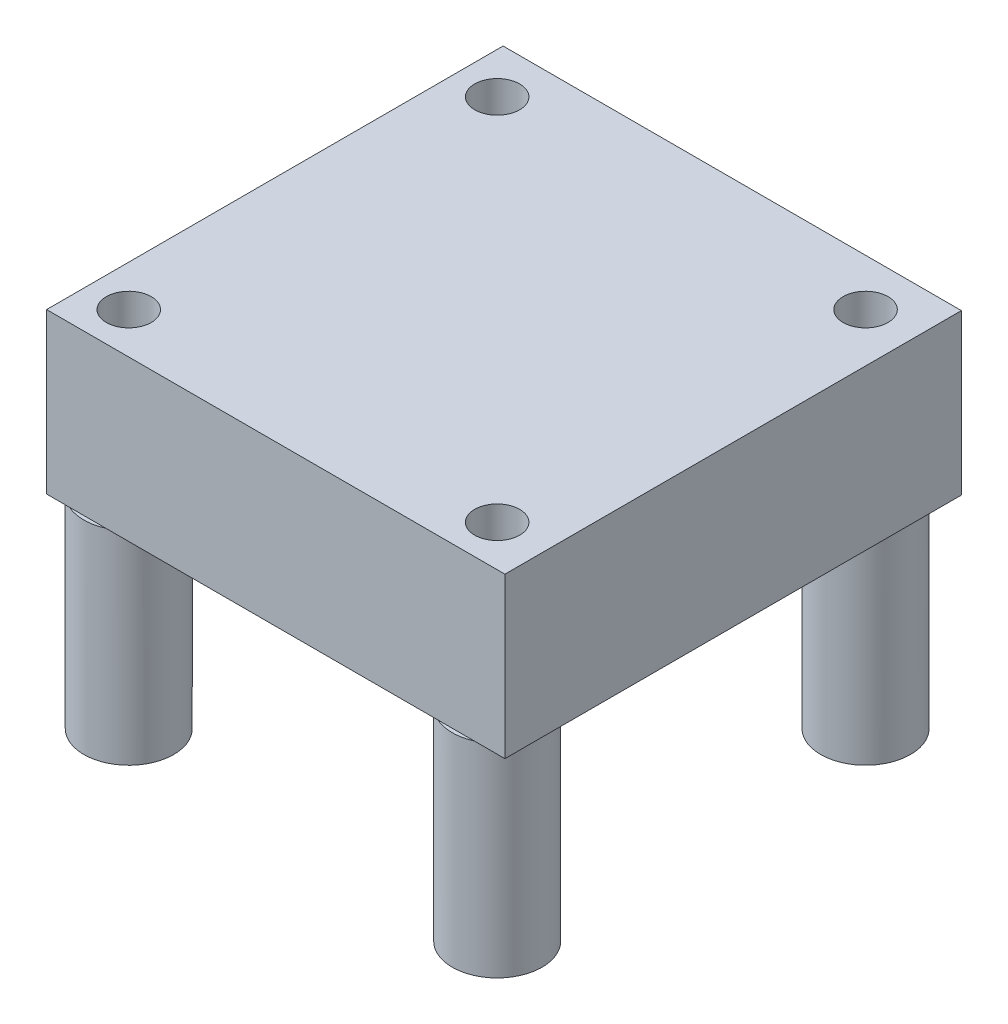
ISO-10303-21;
HEADER;
FILE_DESCRIPTION(('STEP AP214'),'2;1');
FILE_NAME('part.step','',(''),(''),'','','');
FILE_SCHEMA(('AUTOMOTIVE_DESIGN { 1 0 10303 214 1 1 1 1 }'));
ENDSEC;
DATA;
#1=APPLICATION_CONTEXT('core data for automotive mechanical design processes');
#2=APPLICATION_PROTOCOL_DEFINITION('international standard','automotive_design',2000,#1);
#3=PRODUCT_CONTEXT('',#1,'mechanical');
#4=PRODUCT('Part','Part','',(#3));
#5=PRODUCT_RELATED_PRODUCT_CATEGORY('part','',(#4));
#6=PRODUCT_DEFINITION_FORMATION('','',#4);
#7=PRODUCT_DEFINITION_CONTEXT('part definition',#1,'design');
#8=PRODUCT_DEFINITION('design','',#6,#7);
#9=PRODUCT_DEFINITION_SHAPE('','',#8);
#10=(LENGTH_UNIT() NAMED_UNIT(*) SI_UNIT(.MILLI.,.METRE.));
#11=(NAMED_UNIT(*) PLANE_ANGLE_UNIT() SI_UNIT($,.RADIAN.));
#12=(NAMED_UNIT(*) SI_UNIT($,.STERADIAN.) SOLID_ANGLE_UNIT());
#13=UNCERTAINTY_MEASURE_WITH_UNIT(LENGTH_MEASURE(1.E-05),#10,'distance_accuracy_value','');
#14=(GEOMETRIC_REPRESENTATION_CONTEXT(3) GLOBAL_UNCERTAINTY_ASSIGNED_CONTEXT((#13)) GLOBAL_UNIT_ASSIGNED_CONTEXT((#10,
#11,#12)) REPRESENTATION_CONTEXT('',''));
#15=CARTESIAN_POINT('',(0.,0.,0.));
#16=DIRECTION('',(0.,0.,1.));
#17=DIRECTION('',(1.,0.,0.));
#18=AXIS2_PLACEMENT_3D('',#15,#16,#17);
#19=CARTESIAN_POINT('',(0.,0.,0.));
#20=DIRECTION('',(0.,1.,0.));
#21=DIRECTION('',(0.,0.,1.));
#22=AXIS2_PLACEMENT_3D('',#19,#20,#21);
#23=PLANE('',#22);
#24=CARTESIAN_POINT('',(-14.5779448621554,0.,11.6379426065163));
#25=DIRECTION('',(0.,-1.,0.));
#26=DIRECTION('',(0.,0.,-1.));
#27=AXIS2_PLACEMENT_3D('',#24,#25,#26);
#28=CIRCLE('',#27,2.5);
#29=CARTESIAN_POINT('',(-15.58997450599,0.,13.9239426065163));
#30=VERTEX_POINT('',#29);
#31=CARTESIAN_POINT('',(-16.8639448621554,0.,12.6499722503509));
#32=VERTEX_POINT('',#31);
#33=EDGE_CURVE('E176',#30,#32,#28,.T.);
#34=ORIENTED_EDGE('',*,*,#33,.F.);
#35=DIRECTION('',(1.,0.,0.));
#36=VECTOR('',#35,1.);
#37=CARTESIAN_POINT('',(-16.8639448621554,0.,13.9239426065163));
#38=LINE('',#37,#36);
#39=CARTESIAN_POINT('',(-16.8639448621554,0.,13.9239426065163));
#40=VERTEX_POINT('',#39);
#41=EDGE_CURVE('E159',#40,#30,#38,.T.);
#42=ORIENTED_EDGE('',*,*,#41,.F.);
#43=DIRECTION('',(0.,0.,1.));
#44=VECTOR('',#43,1.);
#45=CARTESIAN_POINT('',(-16.8639448621554,0.,-11.4760573934837));
#46=LINE('',#45,#44);
#47=EDGE_CURVE('E111',#32,#40,#46,.T.);
#48=ORIENTED_EDGE('',*,*,#47,.F.);
#49=EDGE_LOOP('',(#34,#42,#48));
#50=FACE_BOUND('',#49,.T.);
#51=ADVANCED_FACE('F36',(#50),#23,.F.);
#52=CARTESIAN_POINT('',(-16.8639448621554,8.89,-11.4760573934837));
#53=DIRECTION('',(1.,0.,0.));
#54=DIRECTION('',(0.,0.,-1.));
#55=AXIS2_PLACEMENT_3D('',#52,#53,#54);
#56=PLANE('',#55);
#57=CARTESIAN_POINT('',(-16.8639448621554,0.,-11.4760573934837));
#58=VERTEX_POINT('',#57);
#59=CARTESIAN_POINT('',(-16.8639448621554,0.,-9.87188703731832));
#60=VERTEX_POINT('',#59);
#61=EDGE_CURVE('E106',#58,#60,#46,.T.);
#62=ORIENTED_EDGE('',*,*,#61,.T.);
#63=CARTESIAN_POINT('',(-16.8639448621554,0.,-7.8478277496491));
#64=VERTEX_POINT('',#63);
#65=EDGE_CURVE('E101',#60,#64,#46,.T.);
#66=ORIENTED_EDGE('',*,*,#65,.T.);
#67=CARTESIAN_POINT('',(-16.8639448621554,0.,10.6259129626817));
#68=VERTEX_POINT('',#67);
#69=EDGE_CURVE('E103',#64,#68,#46,.T.);
#70=ORIENTED_EDGE('',*,*,#69,.T.);
#71=EDGE_CURVE('E117',#68,#32,#46,.T.);
#72=ORIENTED_EDGE('',*,*,#71,.T.);
#73=ORIENTED_EDGE('',*,*,#47,.T.);
#74=DIRECTION('',(0.,-1.,0.));
#75=VECTOR('',#74,1.);
#76=CARTESIAN_POINT('',(-16.8639448621554,8.89,13.9239426065163));
#77=LINE('',#76,#75);
#78=CARTESIAN_POINT('',(-16.8639448621554,8.89,13.9239426065163));
#79=VERTEX_POINT('',#78);
#80=EDGE_CURVE('E173',#79,#40,#77,.T.);
#81=ORIENTED_EDGE('',*,*,#80,.F.);
#82=DIRECTION('',(0.,0.,1.));
#83=VECTOR('',#82,1.);
#84=CARTESIAN_POINT('',(-16.8639448621554,8.89,-11.4760573934837));
#85=LINE('',#84,#83);
#86=CARTESIAN_POINT('',(-16.8639448621554,8.89,-11.4760573934837));
#87=VERTEX_POINT('',#86);
#88=EDGE_CURVE('E147',#87,#79,#85,.T.);
#89=ORIENTED_EDGE('',*,*,#88,.F.);
#90=DIRECTION('',(0.,-1.,0.));
#91=VECTOR('',#90,1.);
#92=CARTESIAN_POINT('',(-16.8639448621554,8.89,-11.4760573934837));
#93=LINE('',#92,#91);
#94=EDGE_CURVE('E156',#87,#58,#93,.T.);
#95=ORIENTED_EDGE('',*,*,#94,.T.);
#96=EDGE_LOOP('',(#62,#66,#70,#72,#73,#81,#89,#95));
#97=FACE_BOUND('',#96,.T.);
#98=ADVANCED_FACE('F38',(#97),#56,.F.);
#99=CARTESIAN_POINT('',(-16.8639448621554,8.89,13.9239426065163));
#100=DIRECTION('',(0.,0.,-1.));
#101=DIRECTION('',(-1.,0.,0.));
#102=AXIS2_PLACEMENT_3D('',#99,#100,#101);
#103=PLANE('',#102);
#104=ORIENTED_EDGE('',*,*,#41,.T.);
#105=CARTESIAN_POINT('',(-13.5659152183208,0.,13.9239426065163));
#106=VERTEX_POINT('',#105);
#107=EDGE_CURVE('E163',#30,#106,#38,.T.);
#108=ORIENTED_EDGE('',*,*,#107,.T.);
#109=CARTESIAN_POINT('',(4.90782549401,0.,13.9239426065163));
#110=VERTEX_POINT('',#109);
#111=EDGE_CURVE('E212',#106,#110,#38,.T.);
#112=ORIENTED_EDGE('',*,*,#111,.T.);
#113=CARTESIAN_POINT('',(6.93188478167921,0.,13.9239426065163));
#114=VERTEX_POINT('',#113);
#115=EDGE_CURVE('E227',#110,#114,#38,.T.);
#116=ORIENTED_EDGE('',*,*,#115,.T.);
#117=CARTESIAN_POINT('',(8.63605513784461,0.,13.9239426065163));
#118=VERTEX_POINT('',#117);
#119=EDGE_CURVE('E158',#114,#118,#38,.T.);
#120=ORIENTED_EDGE('',*,*,#119,.T.);
#121=DIRECTION('',(0.,-1.,0.));
#122=VECTOR('',#121,1.);
#123=CARTESIAN_POINT('',(8.63605513784461,8.89,13.9239426065163));
#124=LINE('',#123,#122);
#125=CARTESIAN_POINT('',(8.63605513784461,8.89,13.9239426065163));
#126=VERTEX_POINT('',#125);
#127=EDGE_CURVE('E170',#126,#118,#124,.T.);
#128=ORIENTED_EDGE('',*,*,#127,.F.);
#129=DIRECTION('',(1.,0.,0.));
#130=VECTOR('',#129,1.);
#131=CARTESIAN_POINT('',(-16.8639448621554,8.89,13.9239426065163));
#132=LINE('',#131,#130);
#133=EDGE_CURVE('E150',#79,#126,#132,.T.);
#134=ORIENTED_EDGE('',*,*,#133,.F.);
#135=ORIENTED_EDGE('',*,*,#80,.T.);
#136=EDGE_LOOP('',(#104,#108,#112,#116,#120,#128,#134,#135));
#137=FACE_BOUND('',#136,.T.);
#138=ADVANCED_FACE('F202',(#137),#103,.F.);
#139=CARTESIAN_POINT('',(8.63605513784461,8.89,-11.4760573934837));
#140=DIRECTION('',(-1.,0.,0.));
#141=DIRECTION('',(0.,0.,1.));
#142=AXIS2_PLACEMENT_3D('',#139,#140,#141);
#143=PLANE('',#142);
#144=DIRECTION('',(0.,0.,-1.));
#145=VECTOR('',#144,1.);
#146=CARTESIAN_POINT('',(8.63605513784461,0.,-11.4760573934837));
#147=LINE('',#146,#145);
#148=CARTESIAN_POINT('',(8.63605513784461,0.,-11.4760573934837));
#149=VERTEX_POINT('',#148);
#150=EDGE_CURVE('E162',#118,#149,#147,.T.);
#151=ORIENTED_EDGE('',*,*,#150,.T.);
#152=DIRECTION('',(0.,-1.,0.));
#153=VECTOR('',#152,1.);
#154=CARTESIAN_POINT('',(8.63605513784461,8.89,-11.4760573934837));
#155=LINE('',#154,#153);
#156=CARTESIAN_POINT('',(8.63605513784461,8.89,-11.4760573934837));
#157=VERTEX_POINT('',#156);
#158=EDGE_CURVE('E167',#157,#149,#155,.T.);
#159=ORIENTED_EDGE('',*,*,#158,.F.);
#160=DIRECTION('',(0.,0.,-1.));
#161=VECTOR('',#160,1.);
#162=CARTESIAN_POINT('',(8.63605513784461,8.89,-11.4760573934837));
#163=LINE('',#162,#161);
#164=EDGE_CURVE('E153',#126,#157,#163,.T.);
#165=ORIENTED_EDGE('',*,*,#164,.F.);
#166=ORIENTED_EDGE('',*,*,#127,.T.);
#167=EDGE_LOOP('',(#151,#159,#165,#166));
#168=FACE_BOUND('',#167,.T.);
#169=ADVANCED_FACE('F225',(#168),#143,.F.);
#170=CARTESIAN_POINT('',(-16.8639448621554,8.89,-11.4760573934837));
#171=DIRECTION('',(0.,0.,1.));
#172=DIRECTION('',(1.,0.,0.));
#173=AXIS2_PLACEMENT_3D('',#170,#171,#172);
#174=PLANE('',#173);
#175=DIRECTION('',(-1.,0.,0.));
#176=VECTOR('',#175,1.);
#177=CARTESIAN_POINT('',(-16.8639448621554,0.,-11.4760573934837));
#178=LINE('',#177,#176);
#179=EDGE_CURVE('E151',#149,#58,#178,.T.);
#180=ORIENTED_EDGE('',*,*,#179,.T.);
#181=ORIENTED_EDGE('',*,*,#94,.F.);
#182=DIRECTION('',(-1.,0.,0.));
#183=VECTOR('',#182,1.);
#184=CARTESIAN_POINT('',(-16.8639448621554,8.89,-11.4760573934837));
#185=LINE('',#184,#183);
#186=EDGE_CURVE('E155',#157,#87,#185,.T.);
#187=ORIENTED_EDGE('',*,*,#186,.F.);
#188=ORIENTED_EDGE('',*,*,#158,.T.);
#189=EDGE_LOOP('',(#180,#181,#187,#188));
#190=FACE_BOUND('',#189,.T.);
#191=ADVANCED_FACE('F193',(#190),#174,.F.);
#192=CARTESIAN_POINT('',(0.,8.89,0.));
#193=DIRECTION('',(0.,1.,0.));
#194=DIRECTION('',(0.,0.,1.));
#195=AXIS2_PLACEMENT_3D('',#192,#193,#194);
#196=PLANE('',#195);
#197=CARTESIAN_POINT('',(5.91985513784461,8.89,11.6379426065163));
#198=DIRECTION('',(0.,-1.,0.));
#199=DIRECTION('',(0.,0.,-1.));
#200=AXIS2_PLACEMENT_3D('',#197,#198,#199);
#201=CIRCLE('',#200,1.25);
#202=CARTESIAN_POINT('',(5.91985513784461,8.89,10.3879426065163));
#203=VERTEX_POINT('',#202);
#204=EDGE_CURVE('E474',#203,#203,#201,.T.);
#205=ORIENTED_EDGE('',*,*,#204,.T.);
#206=EDGE_LOOP('',(#205));
#207=FACE_BOUND('',#206,.T.);
#208=CARTESIAN_POINT('',(5.91985513784461,8.89,-8.85985739348371));
#209=DIRECTION('',(0.,-1.,0.));
#210=DIRECTION('',(0.,0.,-1.));
#211=AXIS2_PLACEMENT_3D('',#208,#209,#210);
#212=CIRCLE('',#211,1.25);
#213=CARTESIAN_POINT('',(5.91985513784461,8.89,-10.1098573934837));
#214=VERTEX_POINT('',#213);
#215=EDGE_CURVE('E468',#214,#214,#212,.T.);
#216=ORIENTED_EDGE('',*,*,#215,.T.);
#217=EDGE_LOOP('',(#216));
#218=FACE_BOUND('',#217,.T.);
#219=CARTESIAN_POINT('',(-14.5779448621554,8.89,-8.85985739348371));
#220=DIRECTION('',(0.,-1.,0.));
#221=DIRECTION('',(0.,0.,-1.));
#222=AXIS2_PLACEMENT_3D('',#219,#220,#221);
#223=CIRCLE('',#222,1.25);
#224=CARTESIAN_POINT('',(-14.5779448621554,8.89,-10.1098573934837));
#225=VERTEX_POINT('',#224);
#226=EDGE_CURVE('E458',#225,#225,#223,.T.);
#227=ORIENTED_EDGE('',*,*,#226,.T.);
#228=EDGE_LOOP('',(#227));
#229=FACE_BOUND('',#228,.T.);
#230=CARTESIAN_POINT('',(-14.5779448621554,8.89,11.6379426065163));
#231=DIRECTION('',(0.,-1.,0.));
#232=DIRECTION('',(0.,0.,-1.));
#233=AXIS2_PLACEMENT_3D('',#230,#231,#232);
#234=CIRCLE('',#233,1.25);
#235=CARTESIAN_POINT('',(-14.5779448621554,8.89,10.3879426065163));
#236=VERTEX_POINT('',#235);
#237=EDGE_CURVE('E129',#236,#236,#234,.T.);
#238=ORIENTED_EDGE('',*,*,#237,.T.);
#239=EDGE_LOOP('',(#238));
#240=FACE_BOUND('',#239,.T.);
#241=ORIENTED_EDGE('',*,*,#88,.T.);
#242=ORIENTED_EDGE('',*,*,#133,.T.);
#243=ORIENTED_EDGE('',*,*,#164,.T.);
#244=ORIENTED_EDGE('',*,*,#186,.T.);
#245=EDGE_LOOP('',(#241,#242,#243,#244));
#246=FACE_BOUND('',#245,.T.);
#247=ADVANCED_FACE('F183',(#207,#218,#229,#240,#246),#196,.T.);
#248=CARTESIAN_POINT('',(-14.5779448621554,0.,-8.85985739348371));
#249=DIRECTION('',(0.,1.,0.));
#250=DIRECTION('',(0.,0.,1.));
#251=AXIS2_PLACEMENT_3D('',#248,#249,#250);
#252=CIRCLE('',#251,2.5);
#253=EDGE_CURVE('E11',#60,#64,#252,.F.);
#254=ORIENTED_EDGE('',*,*,#253,.F.);
#255=ORIENTED_EDGE('',*,*,#61,.F.);
#256=ORIENTED_EDGE('',*,*,#179,.F.);
#257=ORIENTED_EDGE('',*,*,#150,.F.);
#258=ORIENTED_EDGE('',*,*,#119,.F.);
#259=CARTESIAN_POINT('',(5.91985513784461,0.,11.6379426065163));
#260=DIRECTION('',(0.,1.,0.));
#261=DIRECTION('',(0.,0.,1.));
#262=AXIS2_PLACEMENT_3D('',#259,#260,#261);
#263=CIRCLE('',#262,2.5);
#264=EDGE_CURVE('E56',#110,#114,#263,.F.);
#265=ORIENTED_EDGE('',*,*,#264,.F.);
#266=ORIENTED_EDGE('',*,*,#111,.F.);
#267=EDGE_CURVE('E115',#68,#106,#28,.T.);
#268=ORIENTED_EDGE('',*,*,#267,.F.);
#269=ORIENTED_EDGE('',*,*,#69,.F.);
#270=EDGE_LOOP('',(#254,#255,#256,#257,#258,#265,#266,#268,#269));
#271=FACE_BOUND('',#270,.T.);
#272=CARTESIAN_POINT('',(5.91985513784461,0.,-8.85985739348371));
#273=DIRECTION('',(0.,1.,0.));
#274=DIRECTION('',(0.,0.,1.));
#275=AXIS2_PLACEMENT_3D('',#272,#273,#274);
#276=CIRCLE('',#275,2.5);
#277=CARTESIAN_POINT('',(5.91985513784461,0.,-6.35985739348371));
#278=VERTEX_POINT('',#277);
#279=EDGE_CURVE('E44',#278,#278,#276,.F.);
#280=ORIENTED_EDGE('',*,*,#279,.F.);
#281=EDGE_LOOP('',(#280));
#282=FACE_BOUND('',#281,.T.);
#283=ADVANCED_FACE('F112',(#271,#282),#23,.F.);
#284=CARTESIAN_POINT('',(-14.5779448621554,0.,11.6379426065163));
#285=DIRECTION('',(0.,-1.,0.));
#286=DIRECTION('',(0.,0.,-1.));
#287=AXIS2_PLACEMENT_3D('',#284,#285,#286);
#288=PLANE('',#287);
#289=ORIENTED_EDGE('',*,*,#71,.F.);
#290=EDGE_CURVE('E138',#32,#68,#28,.T.);
#291=ORIENTED_EDGE('',*,*,#290,.F.);
#292=EDGE_LOOP('',(#289,#291));
#293=FACE_BOUND('',#292,.T.);
#294=ADVANCED_FACE('F182',(#293),#288,.F.);
#295=CARTESIAN_POINT('',(-14.5779448621554,-11.303,11.6379426065163));
#296=DIRECTION('',(0.,1.,0.));
#297=DIRECTION('',(0.,0.,1.));
#298=AXIS2_PLACEMENT_3D('',#295,#296,#297);
#299=CYLINDRICAL_SURFACE('',#298,2.5);
#300=CARTESIAN_POINT('',(-14.5779448621554,-11.303,11.6379426065163));
#301=DIRECTION('',(0.,-1.,0.));
#302=DIRECTION('',(0.,0.,-1.));
#303=AXIS2_PLACEMENT_3D('',#300,#301,#302);
#304=CIRCLE('',#303,2.5);
#305=CARTESIAN_POINT('',(-14.5779448621554,-11.303,9.13794260651629));
#306=VERTEX_POINT('',#305);
#307=EDGE_CURVE('E141',#306,#306,#304,.T.);
#308=ORIENTED_EDGE('',*,*,#307,.F.);
#309=EDGE_LOOP('',(#308));
#310=FACE_BOUND('',#309,.T.);
#311=EDGE_CURVE('E144',#106,#30,#28,.T.);
#312=ORIENTED_EDGE('',*,*,#311,.T.);
#313=ORIENTED_EDGE('',*,*,#33,.T.);
#314=ORIENTED_EDGE('',*,*,#290,.T.);
#315=ORIENTED_EDGE('',*,*,#267,.T.);
#316=EDGE_LOOP('',(#312,#313,#314,#315));
#317=FACE_BOUND('',#316,.T.);
#318=ADVANCED_FACE('F189',(#310,#317),#299,.T.);
#319=CARTESIAN_POINT('',(-14.5779448621554,-11.303,11.6379426065163));
#320=DIRECTION('',(0.,-1.,0.));
#321=DIRECTION('',(0.,0.,-1.));
#322=AXIS2_PLACEMENT_3D('',#319,#320,#321);
#323=PLANE('',#322);
#324=CARTESIAN_POINT('',(-14.5779448621554,-11.303,11.6379426065163));
#325=DIRECTION('',(0.,-1.,0.));
#326=DIRECTION('',(0.,0.,-1.));
#327=AXIS2_PLACEMENT_3D('',#324,#325,#326);
#328=CIRCLE('',#327,1.25);
#329=CARTESIAN_POINT('',(-14.5779448621554,-11.303,10.3879426065163));
#330=VERTEX_POINT('',#329);
#331=EDGE_CURVE('E132',#330,#330,#328,.T.);
#332=ORIENTED_EDGE('',*,*,#331,.F.);
#333=EDGE_LOOP('',(#332));
#334=FACE_BOUND('',#333,.T.);
#335=ORIENTED_EDGE('',*,*,#307,.T.);
#336=EDGE_LOOP('',(#335));
#337=FACE_BOUND('',#336,.T.);
#338=ADVANCED_FACE('F249',(#334,#337),#323,.T.);
#339=ORIENTED_EDGE('',*,*,#107,.F.);
#340=ORIENTED_EDGE('',*,*,#311,.F.);
#341=EDGE_LOOP('',(#339,#340));
#342=FACE_BOUND('',#341,.T.);
#343=ADVANCED_FACE('F192',(#342),#288,.F.);
#344=CARTESIAN_POINT('',(5.91985513784461,0.,11.6379426065163));
#345=DIRECTION('',(0.,-1.,0.));
#346=DIRECTION('',(0.,0.,-1.));
#347=AXIS2_PLACEMENT_3D('',#344,#345,#346);
#348=PLANE('',#347);
#349=CARTESIAN_POINT('',(5.91985513784461,0.,11.6379426065163));
#350=DIRECTION('',(0.,-1.,0.));
#351=DIRECTION('',(0.,0.,-1.));
#352=AXIS2_PLACEMENT_3D('',#349,#350,#351);
#353=CIRCLE('',#352,2.5);
#354=EDGE_CURVE('E135',#114,#110,#353,.T.);
#355=ORIENTED_EDGE('',*,*,#354,.F.);
#356=ORIENTED_EDGE('',*,*,#115,.F.);
#357=EDGE_LOOP('',(#355,#356));
#358=FACE_BOUND('',#357,.T.);
#359=ADVANCED_FACE('F230',(#358),#348,.F.);
#360=CARTESIAN_POINT('',(5.91985513784461,-11.303,11.6379426065163));
#361=DIRECTION('',(0.,1.,0.));
#362=DIRECTION('',(0.,0.,1.));
#363=AXIS2_PLACEMENT_3D('',#360,#361,#362);
#364=CYLINDRICAL_SURFACE('',#363,2.5);
#365=CARTESIAN_POINT('',(5.91985513784461,-11.303,11.6379426065163));
#366=DIRECTION('',(0.,-1.,0.));
#367=DIRECTION('',(0.,0.,-1.));
#368=AXIS2_PLACEMENT_3D('',#365,#366,#367);
#369=CIRCLE('',#368,2.5);
#370=CARTESIAN_POINT('',(5.91985513784461,-11.303,9.13794260651629));
#371=VERTEX_POINT('',#370);
#372=EDGE_CURVE('E126',#371,#371,#369,.T.);
#373=ORIENTED_EDGE('',*,*,#372,.F.);
#374=EDGE_LOOP('',(#373));
#375=FACE_BOUND('',#374,.T.);
#376=ORIENTED_EDGE('',*,*,#354,.T.);
#377=ORIENTED_EDGE('',*,*,#264,.T.);
#378=EDGE_LOOP('',(#376,#377));
#379=FACE_BOUND('',#378,.T.);
#380=ADVANCED_FACE('F232',(#375,#379),#364,.T.);
#381=CARTESIAN_POINT('',(5.91985513784461,-11.303,11.6379426065163));
#382=DIRECTION('',(0.,-1.,0.));
#383=DIRECTION('',(0.,0.,-1.));
#384=AXIS2_PLACEMENT_3D('',#381,#382,#383);
#385=PLANE('',#384);
#386=CARTESIAN_POINT('',(5.91985513784461,-11.303,11.6379426065163));
#387=DIRECTION('',(0.,-1.,0.));
#388=DIRECTION('',(0.,0.,-1.));
#389=AXIS2_PLACEMENT_3D('',#386,#387,#388);
#390=CIRCLE('',#389,1.25);
#391=CARTESIAN_POINT('',(5.91985513784461,-11.303,10.3879426065163));
#392=VERTEX_POINT('',#391);
#393=EDGE_CURVE('E471',#392,#392,#390,.T.);
#394=ORIENTED_EDGE('',*,*,#393,.F.);
#395=EDGE_LOOP('',(#394));
#396=FACE_BOUND('',#395,.T.);
#397=ORIENTED_EDGE('',*,*,#372,.T.);
#398=EDGE_LOOP('',(#397));
#399=FACE_BOUND('',#398,.T.);
#400=ADVANCED_FACE('F234',(#396,#399),#385,.T.);
#401=CARTESIAN_POINT('',(5.91985513784461,-11.303,-8.85985739348371));
#402=DIRECTION('',(0.,1.,0.));
#403=DIRECTION('',(0.,0.,1.));
#404=AXIS2_PLACEMENT_3D('',#401,#402,#403);
#405=CYLINDRICAL_SURFACE('',#404,2.5);
#406=CARTESIAN_POINT('',(5.91985513784461,-11.303,-8.85985739348371));
#407=DIRECTION('',(0.,-1.,0.));
#408=DIRECTION('',(0.,0.,-1.));
#409=AXIS2_PLACEMENT_3D('',#406,#407,#408);
#410=CIRCLE('',#409,2.5);
#411=CARTESIAN_POINT('',(5.91985513784461,-11.303,-11.3598573934837));
#412=VERTEX_POINT('',#411);
#413=EDGE_CURVE('E122',#412,#412,#410,.T.);
#414=ORIENTED_EDGE('',*,*,#413,.F.);
#415=EDGE_LOOP('',(#414));
#416=FACE_BOUND('',#415,.T.);
#417=ORIENTED_EDGE('',*,*,#279,.T.);
#418=EDGE_LOOP('',(#417));
#419=FACE_BOUND('',#418,.T.);
#420=ADVANCED_FACE('F180',(#416,#419),#405,.T.);
#421=CARTESIAN_POINT('',(5.91985513784461,-11.303,-8.85985739348371));
#422=DIRECTION('',(0.,-1.,0.));
#423=DIRECTION('',(0.,0.,-1.));
#424=AXIS2_PLACEMENT_3D('',#421,#422,#423);
#425=PLANE('',#424);
#426=CARTESIAN_POINT('',(5.91985513784461,-11.303,-8.85985739348371));
#427=DIRECTION('',(0.,-1.,0.));
#428=DIRECTION('',(0.,0.,-1.));
#429=AXIS2_PLACEMENT_3D('',#426,#427,#428);
#430=CIRCLE('',#429,1.25);
#431=CARTESIAN_POINT('',(5.91985513784461,-11.303,-10.1098573934837));
#432=VERTEX_POINT('',#431);
#433=EDGE_CURVE('E463',#432,#432,#430,.T.);
#434=ORIENTED_EDGE('',*,*,#433,.F.);
#435=EDGE_LOOP('',(#434));
#436=FACE_BOUND('',#435,.T.);
#437=ORIENTED_EDGE('',*,*,#413,.T.);
#438=EDGE_LOOP('',(#437));
#439=FACE_BOUND('',#438,.T.);
#440=ADVANCED_FACE('F246',(#436,#439),#425,.T.);
#441=CARTESIAN_POINT('',(-14.5779448621554,0.,-8.85985739348371));
#442=DIRECTION('',(0.,-1.,0.));
#443=DIRECTION('',(0.,0.,-1.));
#444=AXIS2_PLACEMENT_3D('',#441,#442,#443);
#445=PLANE('',#444);
#446=CARTESIAN_POINT('',(-14.5779448621554,0.,-8.85985739348371));
#447=DIRECTION('',(0.,-1.,0.));
#448=DIRECTION('',(0.,0.,-1.));
#449=AXIS2_PLACEMENT_3D('',#446,#447,#448);
#450=CIRCLE('',#449,2.5);
#451=EDGE_CURVE('E120',#64,#60,#450,.T.);
#452=ORIENTED_EDGE('',*,*,#451,.F.);
#453=ORIENTED_EDGE('',*,*,#65,.F.);
#454=EDGE_LOOP('',(#452,#453));
#455=FACE_BOUND('',#454,.T.);
#456=ADVANCED_FACE('F121',(#455),#445,.F.);
#457=CARTESIAN_POINT('',(-14.5779448621554,-11.303,-8.85985739348371));
#458=DIRECTION('',(0.,1.,0.));
#459=DIRECTION('',(0.,0.,1.));
#460=AXIS2_PLACEMENT_3D('',#457,#458,#459);
#461=CYLINDRICAL_SURFACE('',#460,2.5);
#462=CARTESIAN_POINT('',(-14.5779448621554,-11.303,-8.85985739348371));
#463=DIRECTION('',(0.,-1.,0.));
#464=DIRECTION('',(0.,0.,-1.));
#465=AXIS2_PLACEMENT_3D('',#462,#463,#464);
#466=CIRCLE('',#465,2.5);
#467=CARTESIAN_POINT('',(-14.5779448621554,-11.303,-11.3598573934837));
#468=VERTEX_POINT('',#467);
#469=EDGE_CURVE('E123',#468,#468,#466,.T.);
#470=ORIENTED_EDGE('',*,*,#469,.F.);
#471=EDGE_LOOP('',(#470));
#472=FACE_BOUND('',#471,.T.);
#473=ORIENTED_EDGE('',*,*,#451,.T.);
#474=ORIENTED_EDGE('',*,*,#253,.T.);
#475=EDGE_LOOP('',(#473,#474));
#476=FACE_BOUND('',#475,.T.);
#477=ADVANCED_FACE('F119',(#472,#476),#461,.T.);
#478=CARTESIAN_POINT('',(-14.5779448621554,-11.303,-8.85985739348371));
#479=DIRECTION('',(0.,-1.,0.));
#480=DIRECTION('',(0.,0.,-1.));
#481=AXIS2_PLACEMENT_3D('',#478,#479,#480);
#482=PLANE('',#481);
#483=CARTESIAN_POINT('',(-14.5779448621554,-11.303,-8.85985739348371));
#484=DIRECTION('',(0.,-1.,0.));
#485=DIRECTION('',(0.,0.,-1.));
#486=AXIS2_PLACEMENT_3D('',#483,#484,#485);
#487=CIRCLE('',#486,1.25);
#488=CARTESIAN_POINT('',(-14.5779448621554,-11.303,-10.1098573934837));
#489=VERTEX_POINT('',#488);
#490=EDGE_CURVE('E456',#489,#489,#487,.T.);
#491=ORIENTED_EDGE('',*,*,#490,.F.);
#492=EDGE_LOOP('',(#491));
#493=FACE_BOUND('',#492,.T.);
#494=ORIENTED_EDGE('',*,*,#469,.T.);
#495=EDGE_LOOP('',(#494));
#496=FACE_BOUND('',#495,.T.);
#497=ADVANCED_FACE('F311',(#493,#496),#482,.T.);
#498=CARTESIAN_POINT('',(-14.5779448621554,8.89,-8.85985739348371));
#499=DIRECTION('',(0.,-1.,0.));
#500=DIRECTION('',(0.,0.,-1.));
#501=AXIS2_PLACEMENT_3D('',#498,#499,#500);
#502=CYLINDRICAL_SURFACE('',#501,1.25);
#503=ORIENTED_EDGE('',*,*,#226,.F.);
#504=EDGE_LOOP('',(#503));
#505=FACE_BOUND('',#504,.T.);
#506=ORIENTED_EDGE('',*,*,#490,.T.);
#507=EDGE_LOOP('',(#506));
#508=FACE_BOUND('',#507,.T.);
#509=ADVANCED_FACE('F393',(#505,#508),#502,.F.);
#510=CARTESIAN_POINT('',(5.91985513784461,8.89,-8.85985739348371));
#511=DIRECTION('',(0.,-1.,0.));
#512=DIRECTION('',(0.,0.,-1.));
#513=AXIS2_PLACEMENT_3D('',#510,#511,#512);
#514=CYLINDRICAL_SURFACE('',#513,1.25);
#515=ORIENTED_EDGE('',*,*,#215,.F.);
#516=EDGE_LOOP('',(#515));
#517=FACE_BOUND('',#516,.T.);
#518=ORIENTED_EDGE('',*,*,#433,.T.);
#519=EDGE_LOOP('',(#518));
#520=FACE_BOUND('',#519,.T.);
#521=ADVANCED_FACE('F403',(#517,#520),#514,.F.);
#522=CARTESIAN_POINT('',(5.91985513784461,8.89,11.6379426065163));
#523=DIRECTION('',(0.,-1.,0.));
#524=DIRECTION('',(0.,0.,-1.));
#525=AXIS2_PLACEMENT_3D('',#522,#523,#524);
#526=CYLINDRICAL_SURFACE('',#525,1.25);
#527=ORIENTED_EDGE('',*,*,#204,.F.);
#528=EDGE_LOOP('',(#527));
#529=FACE_BOUND('',#528,.T.);
#530=ORIENTED_EDGE('',*,*,#393,.T.);
#531=EDGE_LOOP('',(#530));
#532=FACE_BOUND('',#531,.T.);
#533=ADVANCED_FACE('F413',(#529,#532),#526,.F.);
#534=CARTESIAN_POINT('',(-14.5779448621554,8.89,11.6379426065163));
#535=DIRECTION('',(0.,-1.,0.));
#536=DIRECTION('',(0.,0.,-1.));
#537=AXIS2_PLACEMENT_3D('',#534,#535,#536);
#538=CYLINDRICAL_SURFACE('',#537,1.25);
#539=ORIENTED_EDGE('',*,*,#237,.F.);
#540=EDGE_LOOP('',(#539));
#541=FACE_BOUND('',#540,.T.);
#542=ORIENTED_EDGE('',*,*,#331,.T.);
#543=EDGE_LOOP('',(#542));
#544=FACE_BOUND('',#543,.T.);
#545=ADVANCED_FACE('F423',(#541,#544),#538,.F.);
#546=CLOSED_SHELL('',(#51,#98,#138,#169,#191,#247,#283,#294,#318,#338,#343,#359,#380,#400,#420,
#440,#456,#477,#497,#509,#521,#533,#545));
#547=MANIFOLD_SOLID_BREP('B2',#546);
#548=ADVANCED_BREP_SHAPE_REPRESENTATION('',(#18,#547),#14);
#549=SHAPE_DEFINITION_REPRESENTATION(#9,#548);
ENDSEC;
END-ISO-10303-21;
